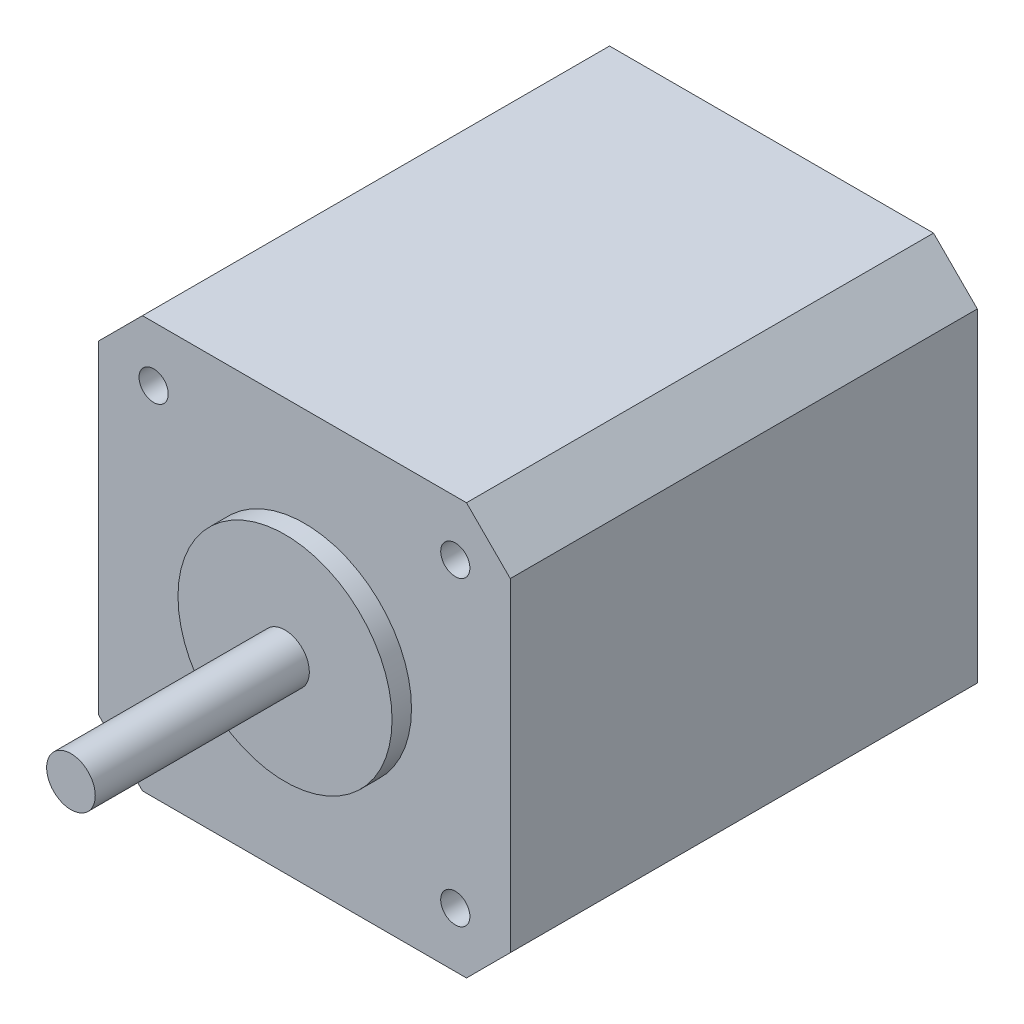
ISO-10303-21;
HEADER;
FILE_DESCRIPTION(('STEP AP214'),'2;1');
FILE_NAME('part.step','',(''),(''),'','','');
FILE_SCHEMA(('AUTOMOTIVE_DESIGN { 1 0 10303 214 1 1 1 1 }'));
ENDSEC;
DATA;
#1=APPLICATION_CONTEXT('core data for automotive mechanical design processes');
#2=APPLICATION_PROTOCOL_DEFINITION('international standard','automotive_design',2000,#1);
#3=PRODUCT_CONTEXT('',#1,'mechanical');
#4=PRODUCT('Part','Part','',(#3));
#5=PRODUCT_RELATED_PRODUCT_CATEGORY('part','',(#4));
#6=PRODUCT_DEFINITION_FORMATION('','',#4);
#7=PRODUCT_DEFINITION_CONTEXT('part definition',#1,'design');
#8=PRODUCT_DEFINITION('design','',#6,#7);
#9=PRODUCT_DEFINITION_SHAPE('','',#8);
#10=(LENGTH_UNIT() NAMED_UNIT(*) SI_UNIT(.MILLI.,.METRE.));
#11=(NAMED_UNIT(*) PLANE_ANGLE_UNIT() SI_UNIT($,.RADIAN.));
#12=(NAMED_UNIT(*) SI_UNIT($,.STERADIAN.) SOLID_ANGLE_UNIT());
#13=UNCERTAINTY_MEASURE_WITH_UNIT(LENGTH_MEASURE(1.E-05),#10,'distance_accuracy_value','');
#14=(GEOMETRIC_REPRESENTATION_CONTEXT(3) GLOBAL_UNCERTAINTY_ASSIGNED_CONTEXT((#13)) GLOBAL_UNIT_ASSIGNED_CONTEXT((#10,
#11,#12)) REPRESENTATION_CONTEXT('',''));
#15=CARTESIAN_POINT('',(0.,0.,0.));
#16=DIRECTION('',(0.,0.,1.));
#17=DIRECTION('',(1.,0.,0.));
#18=AXIS2_PLACEMENT_3D('',#15,#16,#17);
#19=CARTESIAN_POINT('',(0.,0.,48.));
#20=DIRECTION('',(0.,0.,-1.));
#21=DIRECTION('',(-1.,0.,0.));
#22=AXIS2_PLACEMENT_3D('',#19,#20,#21);
#23=PLANE('',#22);
#24=CARTESIAN_POINT('',(0.,0.,48.));
#25=DIRECTION('',(0.,0.,1.));
#26=DIRECTION('',(1.,0.,0.));
#27=AXIS2_PLACEMENT_3D('',#24,#25,#26);
#28=CIRCLE('',#27,11.);
#29=CARTESIAN_POINT('',(11.,0.,48.));
#30=VERTEX_POINT('',#29);
#31=EDGE_CURVE('E179',#30,#30,#28,.T.);
#32=ORIENTED_EDGE('',*,*,#31,.F.);
#33=EDGE_LOOP('',(#32));
#34=FACE_BOUND('',#33,.T.);
#35=DIRECTION('',(1.,0.,0.));
#36=VECTOR('',#35,1.);
#37=CARTESIAN_POINT('',(21.15,-21.15,48.));
#38=LINE('',#37,#36);
#39=CARTESIAN_POINT('',(-16.65,-21.15,48.));
#40=VERTEX_POINT('',#39);
#41=CARTESIAN_POINT('',(16.65,-21.15,48.));
#42=VERTEX_POINT('',#41);
#43=EDGE_CURVE('E170',#40,#42,#38,.T.);
#44=ORIENTED_EDGE('',*,*,#43,.T.);
#45=DIRECTION('',(-0.707106781186549,-0.707106781186546,0.));
#46=VECTOR('',#45,1.);
#47=CARTESIAN_POINT('',(21.15,-16.65,48.));
#48=LINE('',#47,#46);
#49=CARTESIAN_POINT('',(21.15,-16.65,48.));
#50=VERTEX_POINT('',#49);
#51=EDGE_CURVE('E147',#42,#50,#48,.F.);
#52=ORIENTED_EDGE('',*,*,#51,.T.);
#53=DIRECTION('',(0.,1.,0.));
#54=VECTOR('',#53,1.);
#55=CARTESIAN_POINT('',(21.15,21.15,48.));
#56=LINE('',#55,#54);
#57=CARTESIAN_POINT('',(21.15,16.65,48.));
#58=VERTEX_POINT('',#57);
#59=EDGE_CURVE('E117',#50,#58,#56,.T.);
#60=ORIENTED_EDGE('',*,*,#59,.T.);
#61=DIRECTION('',(0.707106781186546,-0.707106781186549,0.));
#62=VECTOR('',#61,1.);
#63=CARTESIAN_POINT('',(16.65,21.15,48.));
#64=LINE('',#63,#62);
#65=CARTESIAN_POINT('',(16.65,21.15,48.));
#66=VERTEX_POINT('',#65);
#67=EDGE_CURVE('E53',#58,#66,#64,.F.);
#68=ORIENTED_EDGE('',*,*,#67,.T.);
#69=DIRECTION('',(-1.,0.,0.));
#70=VECTOR('',#69,1.);
#71=CARTESIAN_POINT('',(21.15,21.15,48.));
#72=LINE('',#71,#70);
#73=CARTESIAN_POINT('',(-16.65,21.15,48.));
#74=VERTEX_POINT('',#73);
#75=EDGE_CURVE('E156',#66,#74,#72,.T.);
#76=ORIENTED_EDGE('',*,*,#75,.T.);
#77=DIRECTION('',(0.70710678118655,0.707106781186545,0.));
#78=VECTOR('',#77,1.);
#79=CARTESIAN_POINT('',(-21.15,16.65,48.));
#80=LINE('',#79,#78);
#81=CARTESIAN_POINT('',(-21.15,16.65,48.));
#82=VERTEX_POINT('',#81);
#83=EDGE_CURVE('E143',#74,#82,#80,.F.);
#84=ORIENTED_EDGE('',*,*,#83,.T.);
#85=DIRECTION('',(0.,-1.,0.));
#86=VECTOR('',#85,1.);
#87=CARTESIAN_POINT('',(-21.15,21.15,48.));
#88=LINE('',#87,#86);
#89=CARTESIAN_POINT('',(-21.15,-16.65,48.));
#90=VERTEX_POINT('',#89);
#91=EDGE_CURVE('E127',#82,#90,#88,.T.);
#92=ORIENTED_EDGE('',*,*,#91,.T.);
#93=DIRECTION('',(-0.707106781186545,0.70710678118655,0.));
#94=VECTOR('',#93,1.);
#95=CARTESIAN_POINT('',(-16.65,-21.15,48.));
#96=LINE('',#95,#94);
#97=EDGE_CURVE('E145',#90,#40,#96,.F.);
#98=ORIENTED_EDGE('',*,*,#97,.T.);
#99=EDGE_LOOP('',(#44,#52,#60,#68,#76,#84,#92,#98));
#100=FACE_BOUND('',#99,.T.);
#101=CARTESIAN_POINT('',(-15.5,15.5,48.));
#102=DIRECTION('',(0.,0.,1.));
#103=DIRECTION('',(1.,0.,0.));
#104=AXIS2_PLACEMENT_3D('',#101,#102,#103);
#105=CIRCLE('',#104,1.5);
#106=CARTESIAN_POINT('',(-14.,15.5,48.));
#107=VERTEX_POINT('',#106);
#108=EDGE_CURVE('E180',#107,#107,#105,.T.);
#109=ORIENTED_EDGE('',*,*,#108,.F.);
#110=EDGE_LOOP('',(#109));
#111=FACE_BOUND('',#110,.T.);
#112=CARTESIAN_POINT('',(15.5,15.5,48.));
#113=DIRECTION('',(0.,0.,1.));
#114=DIRECTION('',(-1.,0.,0.));
#115=AXIS2_PLACEMENT_3D('',#112,#113,#114);
#116=CIRCLE('',#115,1.5);
#117=CARTESIAN_POINT('',(14.,15.5,48.));
#118=VERTEX_POINT('',#117);
#119=EDGE_CURVE('E185',#118,#118,#116,.T.);
#120=ORIENTED_EDGE('',*,*,#119,.F.);
#121=EDGE_LOOP('',(#120));
#122=FACE_BOUND('',#121,.T.);
#123=CARTESIAN_POINT('',(-15.5,-15.5,48.));
#124=DIRECTION('',(0.,0.,1.));
#125=DIRECTION('',(-1.,0.,0.));
#126=AXIS2_PLACEMENT_3D('',#123,#124,#125);
#127=CIRCLE('',#126,1.5);
#128=CARTESIAN_POINT('',(-17.,-15.5,48.));
#129=VERTEX_POINT('',#128);
#130=EDGE_CURVE('E190',#129,#129,#127,.T.);
#131=ORIENTED_EDGE('',*,*,#130,.F.);
#132=EDGE_LOOP('',(#131));
#133=FACE_BOUND('',#132,.T.);
#134=CARTESIAN_POINT('',(15.5,-15.5,48.));
#135=DIRECTION('',(0.,0.,1.));
#136=DIRECTION('',(1.,0.,0.));
#137=AXIS2_PLACEMENT_3D('',#134,#135,#136);
#138=CIRCLE('',#137,1.5);
#139=CARTESIAN_POINT('',(17.,-15.5,48.));
#140=VERTEX_POINT('',#139);
#141=EDGE_CURVE('E196',#140,#140,#138,.T.);
#142=ORIENTED_EDGE('',*,*,#141,.F.);
#143=EDGE_LOOP('',(#142));
#144=FACE_BOUND('',#143,.T.);
#145=ADVANCED_FACE('F33',(#34,#100,#111,#122,#133,#144),#23,.F.);
#146=CARTESIAN_POINT('',(0.,0.,0.));
#147=DIRECTION('',(0.,0.,-1.));
#148=DIRECTION('',(-1.,0.,0.));
#149=AXIS2_PLACEMENT_3D('',#146,#147,#148);
#150=PLANE('',#149);
#151=CARTESIAN_POINT('',(-15.5,-15.5,0.));
#152=DIRECTION('',(0.,0.,1.));
#153=DIRECTION('',(-1.,0.,0.));
#154=AXIS2_PLACEMENT_3D('',#151,#152,#153);
#155=CIRCLE('',#154,1.5);
#156=CARTESIAN_POINT('',(-17.,-15.5,0.));
#157=VERTEX_POINT('',#156);
#158=EDGE_CURVE('E193',#157,#157,#155,.T.);
#159=ORIENTED_EDGE('',*,*,#158,.T.);
#160=EDGE_LOOP('',(#159));
#161=FACE_BOUND('',#160,.T.);
#162=CARTESIAN_POINT('',(-15.5,15.5,0.));
#163=DIRECTION('',(0.,0.,1.));
#164=DIRECTION('',(1.,0.,0.));
#165=AXIS2_PLACEMENT_3D('',#162,#163,#164);
#166=CIRCLE('',#165,1.5);
#167=CARTESIAN_POINT('',(-14.,15.5,0.));
#168=VERTEX_POINT('',#167);
#169=EDGE_CURVE('E175',#168,#168,#166,.T.);
#170=ORIENTED_EDGE('',*,*,#169,.T.);
#171=EDGE_LOOP('',(#170));
#172=FACE_BOUND('',#171,.T.);
#173=DIRECTION('',(0.,1.,0.));
#174=VECTOR('',#173,1.);
#175=CARTESIAN_POINT('',(21.15,21.15,0.));
#176=LINE('',#175,#174);
#177=CARTESIAN_POINT('',(21.15,-16.65,0.));
#178=VERTEX_POINT('',#177);
#179=CARTESIAN_POINT('',(21.15,16.65,0.));
#180=VERTEX_POINT('',#179);
#181=EDGE_CURVE('E115',#178,#180,#176,.T.);
#182=ORIENTED_EDGE('',*,*,#181,.F.);
#183=DIRECTION('',(0.707106781186549,0.707106781186546,0.));
#184=VECTOR('',#183,1.);
#185=CARTESIAN_POINT('',(18.9,-18.9,0.));
#186=LINE('',#185,#184);
#187=CARTESIAN_POINT('',(16.65,-21.15,0.));
#188=VERTEX_POINT('',#187);
#189=EDGE_CURVE('E98',#178,#188,#186,.F.);
#190=ORIENTED_EDGE('',*,*,#189,.T.);
#191=DIRECTION('',(1.,0.,0.));
#192=VECTOR('',#191,1.);
#193=CARTESIAN_POINT('',(21.15,-21.15,0.));
#194=LINE('',#193,#192);
#195=CARTESIAN_POINT('',(-16.65,-21.15,0.));
#196=VERTEX_POINT('',#195);
#197=EDGE_CURVE('E125',#196,#188,#194,.T.);
#198=ORIENTED_EDGE('',*,*,#197,.F.);
#199=DIRECTION('',(0.707106781186545,-0.70710678118655,0.));
#200=VECTOR('',#199,1.);
#201=CARTESIAN_POINT('',(-18.9000000000001,-18.8999999999999,0.));
#202=LINE('',#201,#200);
#203=CARTESIAN_POINT('',(-21.15,-16.65,0.));
#204=VERTEX_POINT('',#203);
#205=EDGE_CURVE('E109',#196,#204,#202,.F.);
#206=ORIENTED_EDGE('',*,*,#205,.T.);
#207=DIRECTION('',(0.,-1.,0.));
#208=VECTOR('',#207,1.);
#209=CARTESIAN_POINT('',(-21.15,21.15,0.));
#210=LINE('',#209,#208);
#211=CARTESIAN_POINT('',(-21.15,16.65,0.));
#212=VERTEX_POINT('',#211);
#213=EDGE_CURVE('E129',#212,#204,#210,.T.);
#214=ORIENTED_EDGE('',*,*,#213,.F.);
#215=DIRECTION('',(-0.70710678118655,-0.707106781186545,0.));
#216=VECTOR('',#215,1.);
#217=CARTESIAN_POINT('',(-18.8999999999999,18.9,0.));
#218=LINE('',#217,#216);
#219=CARTESIAN_POINT('',(-16.65,21.15,0.));
#220=VERTEX_POINT('',#219);
#221=EDGE_CURVE('E136',#212,#220,#218,.F.);
#222=ORIENTED_EDGE('',*,*,#221,.T.);
#223=DIRECTION('',(-1.,0.,0.));
#224=VECTOR('',#223,1.);
#225=CARTESIAN_POINT('',(21.15,21.15,0.));
#226=LINE('',#225,#224);
#227=CARTESIAN_POINT('',(16.65,21.15,0.));
#228=VERTEX_POINT('',#227);
#229=EDGE_CURVE('E124',#228,#220,#226,.T.);
#230=ORIENTED_EDGE('',*,*,#229,.F.);
#231=DIRECTION('',(-0.707106781186546,0.707106781186549,0.));
#232=VECTOR('',#231,1.);
#233=CARTESIAN_POINT('',(18.9,18.9,0.));
#234=LINE('',#233,#232);
#235=EDGE_CURVE('E118',#228,#180,#234,.F.);
#236=ORIENTED_EDGE('',*,*,#235,.T.);
#237=EDGE_LOOP('',(#182,#190,#198,#206,#214,#222,#230,#236));
#238=FACE_BOUND('',#237,.T.);
#239=CARTESIAN_POINT('',(15.5,15.5,0.));
#240=DIRECTION('',(0.,0.,1.));
#241=DIRECTION('',(-1.,0.,0.));
#242=AXIS2_PLACEMENT_3D('',#239,#240,#241);
#243=CIRCLE('',#242,1.5);
#244=CARTESIAN_POINT('',(14.,15.5,0.));
#245=VERTEX_POINT('',#244);
#246=EDGE_CURVE('E187',#245,#245,#243,.T.);
#247=ORIENTED_EDGE('',*,*,#246,.T.);
#248=EDGE_LOOP('',(#247));
#249=FACE_BOUND('',#248,.T.);
#250=CARTESIAN_POINT('',(15.5,-15.5,0.));
#251=DIRECTION('',(0.,0.,1.));
#252=DIRECTION('',(1.,0.,0.));
#253=AXIS2_PLACEMENT_3D('',#250,#251,#252);
#254=CIRCLE('',#253,1.5);
#255=CARTESIAN_POINT('',(17.,-15.5,0.));
#256=VERTEX_POINT('',#255);
#257=EDGE_CURVE('E199',#256,#256,#254,.T.);
#258=ORIENTED_EDGE('',*,*,#257,.T.);
#259=EDGE_LOOP('',(#258));
#260=FACE_BOUND('',#259,.T.);
#261=ADVANCED_FACE('F121',(#161,#172,#238,#249,#260),#150,.T.);
#262=CARTESIAN_POINT('',(-21.15,21.15,48.));
#263=DIRECTION('',(1.,0.,0.));
#264=DIRECTION('',(0.,1.,0.));
#265=AXIS2_PLACEMENT_3D('',#262,#263,#264);
#266=PLANE('',#265);
#267=ORIENTED_EDGE('',*,*,#213,.T.);
#268=DIRECTION('',(0.,0.,1.));
#269=VECTOR('',#268,1.);
#270=CARTESIAN_POINT('',(-21.15,-16.65,48.));
#271=LINE('',#270,#269);
#272=EDGE_CURVE('E152',#204,#90,#271,.T.);
#273=ORIENTED_EDGE('',*,*,#272,.T.);
#274=ORIENTED_EDGE('',*,*,#91,.F.);
#275=DIRECTION('',(0.,0.,-1.));
#276=VECTOR('',#275,1.);
#277=CARTESIAN_POINT('',(-21.15,16.65,48.));
#278=LINE('',#277,#276);
#279=EDGE_CURVE('E149',#82,#212,#278,.T.);
#280=ORIENTED_EDGE('',*,*,#279,.T.);
#281=EDGE_LOOP('',(#267,#273,#274,#280));
#282=FACE_BOUND('',#281,.T.);
#283=ADVANCED_FACE('F166',(#282),#266,.F.);
#284=CARTESIAN_POINT('',(21.15,-21.15,48.));
#285=DIRECTION('',(0.,1.,0.));
#286=DIRECTION('',(-1.,0.,0.));
#287=AXIS2_PLACEMENT_3D('',#284,#285,#286);
#288=PLANE('',#287);
#289=ORIENTED_EDGE('',*,*,#197,.T.);
#290=DIRECTION('',(0.,0.,1.));
#291=VECTOR('',#290,1.);
#292=CARTESIAN_POINT('',(16.65,-21.15,48.));
#293=LINE('',#292,#291);
#294=EDGE_CURVE('E103',#188,#42,#293,.T.);
#295=ORIENTED_EDGE('',*,*,#294,.T.);
#296=ORIENTED_EDGE('',*,*,#43,.F.);
#297=DIRECTION('',(0.,0.,-1.));
#298=VECTOR('',#297,1.);
#299=CARTESIAN_POINT('',(-16.65,-21.15,48.));
#300=LINE('',#299,#298);
#301=EDGE_CURVE('E108',#40,#196,#300,.T.);
#302=ORIENTED_EDGE('',*,*,#301,.T.);
#303=EDGE_LOOP('',(#289,#295,#296,#302));
#304=FACE_BOUND('',#303,.T.);
#305=ADVANCED_FACE('F259',(#304),#288,.F.);
#306=CARTESIAN_POINT('',(21.15,21.15,48.));
#307=DIRECTION('',(-1.,0.,0.));
#308=DIRECTION('',(0.,-1.,0.));
#309=AXIS2_PLACEMENT_3D('',#306,#307,#308);
#310=PLANE('',#309);
#311=ORIENTED_EDGE('',*,*,#59,.F.);
#312=DIRECTION('',(0.,0.,-1.));
#313=VECTOR('',#312,1.);
#314=CARTESIAN_POINT('',(21.15,-16.65,48.));
#315=LINE('',#314,#313);
#316=EDGE_CURVE('E102',#50,#178,#315,.T.);
#317=ORIENTED_EDGE('',*,*,#316,.T.);
#318=ORIENTED_EDGE('',*,*,#181,.T.);
#319=DIRECTION('',(0.,0.,1.));
#320=VECTOR('',#319,1.);
#321=CARTESIAN_POINT('',(21.15,16.65,48.));
#322=LINE('',#321,#320);
#323=EDGE_CURVE('E119',#180,#58,#322,.T.);
#324=ORIENTED_EDGE('',*,*,#323,.T.);
#325=EDGE_LOOP('',(#311,#317,#318,#324));
#326=FACE_BOUND('',#325,.T.);
#327=ADVANCED_FACE('F114',(#326),#310,.F.);
#328=CARTESIAN_POINT('',(21.15,21.15,48.));
#329=DIRECTION('',(0.,-1.,0.));
#330=DIRECTION('',(0.,0.,-1.));
#331=AXIS2_PLACEMENT_3D('',#328,#329,#330);
#332=PLANE('',#331);
#333=ORIENTED_EDGE('',*,*,#229,.T.);
#334=DIRECTION('',(0.,0.,1.));
#335=VECTOR('',#334,1.);
#336=CARTESIAN_POINT('',(-16.65,21.15,48.));
#337=LINE('',#336,#335);
#338=EDGE_CURVE('E11',#220,#74,#337,.T.);
#339=ORIENTED_EDGE('',*,*,#338,.T.);
#340=ORIENTED_EDGE('',*,*,#75,.F.);
#341=DIRECTION('',(0.,0.,-1.));
#342=VECTOR('',#341,1.);
#343=CARTESIAN_POINT('',(16.65,21.15,48.));
#344=LINE('',#343,#342);
#345=EDGE_CURVE('E41',#66,#228,#344,.T.);
#346=ORIENTED_EDGE('',*,*,#345,.T.);
#347=EDGE_LOOP('',(#333,#339,#340,#346));
#348=FACE_BOUND('',#347,.T.);
#349=ADVANCED_FACE('F155',(#348),#332,.F.);
#350=CARTESIAN_POINT('',(-15.5,15.5,48.));
#351=DIRECTION('',(0.,0.,-1.));
#352=DIRECTION('',(-1.,0.,0.));
#353=AXIS2_PLACEMENT_3D('',#350,#351,#352);
#354=CYLINDRICAL_SURFACE('',#353,1.5);
#355=ORIENTED_EDGE('',*,*,#108,.T.);
#356=EDGE_LOOP('',(#355));
#357=FACE_BOUND('',#356,.T.);
#358=ORIENTED_EDGE('',*,*,#169,.F.);
#359=EDGE_LOOP('',(#358));
#360=FACE_BOUND('',#359,.T.);
#361=ADVANCED_FACE('F266',(#357,#360),#354,.F.);
#362=CARTESIAN_POINT('',(15.5,15.5,48.));
#363=DIRECTION('',(0.,0.,-1.));
#364=DIRECTION('',(-1.,0.,0.));
#365=AXIS2_PLACEMENT_3D('',#362,#363,#364);
#366=CYLINDRICAL_SURFACE('',#365,1.5);
#367=ORIENTED_EDGE('',*,*,#119,.T.);
#368=EDGE_LOOP('',(#367));
#369=FACE_BOUND('',#368,.T.);
#370=ORIENTED_EDGE('',*,*,#246,.F.);
#371=EDGE_LOOP('',(#370));
#372=FACE_BOUND('',#371,.T.);
#373=ADVANCED_FACE('F376',(#369,#372),#366,.F.);
#374=CARTESIAN_POINT('',(-15.5,-15.5,48.));
#375=DIRECTION('',(0.,0.,-1.));
#376=DIRECTION('',(-1.,0.,0.));
#377=AXIS2_PLACEMENT_3D('',#374,#375,#376);
#378=CYLINDRICAL_SURFACE('',#377,1.5);
#379=ORIENTED_EDGE('',*,*,#130,.T.);
#380=EDGE_LOOP('',(#379));
#381=FACE_BOUND('',#380,.T.);
#382=ORIENTED_EDGE('',*,*,#158,.F.);
#383=EDGE_LOOP('',(#382));
#384=FACE_BOUND('',#383,.T.);
#385=ADVANCED_FACE('F249',(#381,#384),#378,.F.);
#386=CARTESIAN_POINT('',(15.5,-15.5,48.));
#387=DIRECTION('',(0.,0.,-1.));
#388=DIRECTION('',(-1.,0.,0.));
#389=AXIS2_PLACEMENT_3D('',#386,#387,#388);
#390=CYLINDRICAL_SURFACE('',#389,1.5);
#391=ORIENTED_EDGE('',*,*,#141,.T.);
#392=EDGE_LOOP('',(#391));
#393=FACE_BOUND('',#392,.T.);
#394=ORIENTED_EDGE('',*,*,#257,.F.);
#395=EDGE_LOOP('',(#394));
#396=FACE_BOUND('',#395,.T.);
#397=ADVANCED_FACE('F232',(#393,#396),#390,.F.);
#398=CARTESIAN_POINT('',(0.,0.,50.));
#399=DIRECTION('',(0.,0.,-1.));
#400=DIRECTION('',(-1.,0.,0.));
#401=AXIS2_PLACEMENT_3D('',#398,#399,#400);
#402=CYLINDRICAL_SURFACE('',#401,11.);
#403=CARTESIAN_POINT('',(0.,0.,50.));
#404=DIRECTION('',(0.,0.,1.));
#405=DIRECTION('',(1.,0.,0.));
#406=AXIS2_PLACEMENT_3D('',#403,#404,#405);
#407=CIRCLE('',#406,11.);
#408=CARTESIAN_POINT('',(11.,0.,50.));
#409=VERTEX_POINT('',#408);
#410=EDGE_CURVE('E202',#409,#409,#407,.T.);
#411=ORIENTED_EDGE('',*,*,#410,.F.);
#412=EDGE_LOOP('',(#411));
#413=FACE_BOUND('',#412,.T.);
#414=ORIENTED_EDGE('',*,*,#31,.T.);
#415=EDGE_LOOP('',(#414));
#416=FACE_BOUND('',#415,.T.);
#417=ADVANCED_FACE('F226',(#413,#416),#402,.T.);
#418=CARTESIAN_POINT('',(0.,0.,50.));
#419=DIRECTION('',(0.,0.,1.));
#420=DIRECTION('',(1.,0.,0.));
#421=AXIS2_PLACEMENT_3D('',#418,#419,#420);
#422=PLANE('',#421);
#423=CARTESIAN_POINT('',(0.,0.,50.));
#424=DIRECTION('',(0.,0.,1.));
#425=DIRECTION('',(1.,0.,0.));
#426=AXIS2_PLACEMENT_3D('',#423,#424,#425);
#427=CIRCLE('',#426,2.5);
#428=CARTESIAN_POINT('',(2.5,0.,50.));
#429=VERTEX_POINT('',#428);
#430=EDGE_CURVE('E133',#429,#429,#427,.T.);
#431=ORIENTED_EDGE('',*,*,#430,.F.);
#432=EDGE_LOOP('',(#431));
#433=FACE_BOUND('',#432,.T.);
#434=ORIENTED_EDGE('',*,*,#410,.T.);
#435=EDGE_LOOP('',(#434));
#436=FACE_BOUND('',#435,.T.);
#437=ADVANCED_FACE('F220',(#433,#436),#422,.T.);
#438=CARTESIAN_POINT('',(0.,0.,72.));
#439=DIRECTION('',(0.,0.,-1.));
#440=DIRECTION('',(-1.,0.,0.));
#441=AXIS2_PLACEMENT_3D('',#438,#439,#440);
#442=CYLINDRICAL_SURFACE('',#441,2.5);
#443=CARTESIAN_POINT('',(0.,0.,72.));
#444=DIRECTION('',(0.,0.,1.));
#445=DIRECTION('',(1.,0.,0.));
#446=AXIS2_PLACEMENT_3D('',#443,#444,#445);
#447=CIRCLE('',#446,2.5);
#448=CARTESIAN_POINT('',(2.5,0.,72.));
#449=VERTEX_POINT('',#448);
#450=EDGE_CURVE('E209',#449,#449,#447,.T.);
#451=ORIENTED_EDGE('',*,*,#450,.F.);
#452=EDGE_LOOP('',(#451));
#453=FACE_BOUND('',#452,.T.);
#454=ORIENTED_EDGE('',*,*,#430,.T.);
#455=EDGE_LOOP('',(#454));
#456=FACE_BOUND('',#455,.T.);
#457=ADVANCED_FACE('F217',(#453,#456),#442,.T.);
#458=CARTESIAN_POINT('',(0.,0.,72.));
#459=DIRECTION('',(0.,0.,1.));
#460=DIRECTION('',(1.,0.,0.));
#461=AXIS2_PLACEMENT_3D('',#458,#459,#460);
#462=PLANE('',#461);
#463=ORIENTED_EDGE('',*,*,#450,.T.);
#464=EDGE_LOOP('',(#463));
#465=FACE_BOUND('',#464,.T.);
#466=ADVANCED_FACE('F215',(#465),#462,.T.);
#467=CARTESIAN_POINT('',(21.15,-16.65,48.));
#468=DIRECTION('',(-0.707106781186547,0.707106781186549,0.));
#469=DIRECTION('',(0.,0.,-1.));
#470=AXIS2_PLACEMENT_3D('',#467,#468,#469);
#471=PLANE('',#470);
#472=ORIENTED_EDGE('',*,*,#51,.F.);
#473=ORIENTED_EDGE('',*,*,#294,.F.);
#474=ORIENTED_EDGE('',*,*,#189,.F.);
#475=ORIENTED_EDGE('',*,*,#316,.F.);
#476=EDGE_LOOP('',(#472,#473,#474,#475));
#477=FACE_BOUND('',#476,.T.);
#478=ADVANCED_FACE('F101',(#477),#471,.F.);
#479=CARTESIAN_POINT('',(-16.65,-21.15,48.));
#480=DIRECTION('',(0.70710678118655,0.707106781186545,0.));
#481=DIRECTION('',(0.,0.,-1.));
#482=AXIS2_PLACEMENT_3D('',#479,#480,#481);
#483=PLANE('',#482);
#484=ORIENTED_EDGE('',*,*,#97,.F.);
#485=ORIENTED_EDGE('',*,*,#272,.F.);
#486=ORIENTED_EDGE('',*,*,#205,.F.);
#487=ORIENTED_EDGE('',*,*,#301,.F.);
#488=EDGE_LOOP('',(#484,#485,#486,#487));
#489=FACE_BOUND('',#488,.T.);
#490=ADVANCED_FACE('F274',(#489),#483,.F.);
#491=CARTESIAN_POINT('',(-21.15,16.65,48.));
#492=DIRECTION('',(0.707106781186545,-0.70710678118655,0.));
#493=DIRECTION('',(0.,0.,-1.));
#494=AXIS2_PLACEMENT_3D('',#491,#492,#493);
#495=PLANE('',#494);
#496=ORIENTED_EDGE('',*,*,#83,.F.);
#497=ORIENTED_EDGE('',*,*,#338,.F.);
#498=ORIENTED_EDGE('',*,*,#221,.F.);
#499=ORIENTED_EDGE('',*,*,#279,.F.);
#500=EDGE_LOOP('',(#496,#497,#498,#499));
#501=FACE_BOUND('',#500,.T.);
#502=ADVANCED_FACE('F163',(#501),#495,.F.);
#503=CARTESIAN_POINT('',(16.65,21.15,48.));
#504=DIRECTION('',(-0.707106781186549,-0.707106781186546,0.));
#505=DIRECTION('',(0.,0.,-1.));
#506=AXIS2_PLACEMENT_3D('',#503,#504,#505);
#507=PLANE('',#506);
#508=ORIENTED_EDGE('',*,*,#67,.F.);
#509=ORIENTED_EDGE('',*,*,#323,.F.);
#510=ORIENTED_EDGE('',*,*,#235,.F.);
#511=ORIENTED_EDGE('',*,*,#345,.F.);
#512=EDGE_LOOP('',(#508,#509,#510,#511));
#513=FACE_BOUND('',#512,.T.);
#514=ADVANCED_FACE('F35',(#513),#507,.F.);
#515=CLOSED_SHELL('',(#145,#261,#283,#305,#327,#349,#361,#373,#385,#397,#417,#437,#457,#466,
#478,#490,#502,#514));
#516=MANIFOLD_SOLID_BREP('B2',#515);
#517=ADVANCED_BREP_SHAPE_REPRESENTATION('',(#18,#516),#14);
#518=SHAPE_DEFINITION_REPRESENTATION(#9,#517);
ENDSEC;
END-ISO-10303-21;
